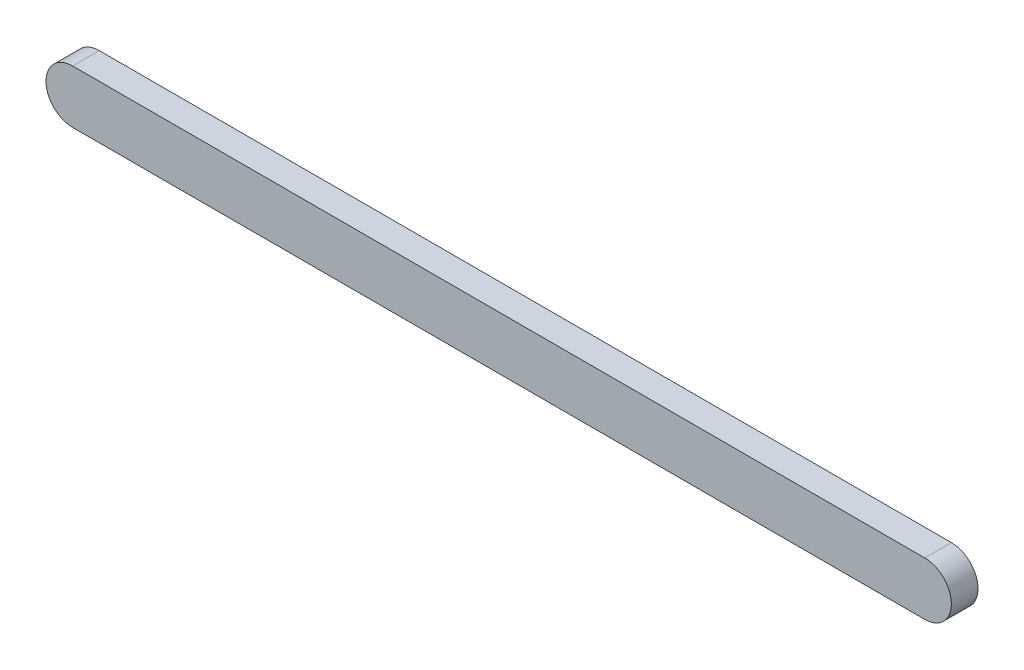
ISO-10303-21;
HEADER;
FILE_DESCRIPTION(('STEP AP214'),'2;1');
FILE_NAME('part.step','',(''),(''),'','','');
FILE_SCHEMA(('AUTOMOTIVE_DESIGN { 1 0 10303 214 1 1 1 1 }'));
ENDSEC;
DATA;
#1=APPLICATION_CONTEXT('core data for automotive mechanical design processes');
#2=APPLICATION_PROTOCOL_DEFINITION('international standard','automotive_design',2000,#1);
#3=PRODUCT_CONTEXT('',#1,'mechanical');
#4=PRODUCT('Part','Part','',(#3));
#5=PRODUCT_RELATED_PRODUCT_CATEGORY('part','',(#4));
#6=PRODUCT_DEFINITION_FORMATION('','',#4);
#7=PRODUCT_DEFINITION_CONTEXT('part definition',#1,'design');
#8=PRODUCT_DEFINITION('design','',#6,#7);
#9=PRODUCT_DEFINITION_SHAPE('','',#8);
#10=(LENGTH_UNIT() NAMED_UNIT(*) SI_UNIT(.MILLI.,.METRE.));
#11=(NAMED_UNIT(*) PLANE_ANGLE_UNIT() SI_UNIT($,.RADIAN.));
#12=(NAMED_UNIT(*) SI_UNIT($,.STERADIAN.) SOLID_ANGLE_UNIT());
#13=UNCERTAINTY_MEASURE_WITH_UNIT(LENGTH_MEASURE(1.E-05),#10,'distance_accuracy_value','');
#14=(GEOMETRIC_REPRESENTATION_CONTEXT(3) GLOBAL_UNCERTAINTY_ASSIGNED_CONTEXT((#13)) GLOBAL_UNIT_ASSIGNED_CONTEXT((#10,
#11,#12)) REPRESENTATION_CONTEXT('',''));
#15=CARTESIAN_POINT('',(0.,0.,0.));
#16=DIRECTION('',(0.,0.,1.));
#17=DIRECTION('',(1.,0.,0.));
#18=AXIS2_PLACEMENT_3D('',#15,#16,#17);
#19=CARTESIAN_POINT('',(0.,0.,2.5));
#20=DIRECTION('',(0.,0.,-1.));
#21=DIRECTION('',(-1.,0.,0.));
#22=AXIS2_PLACEMENT_3D('',#19,#20,#21);
#23=CYLINDRICAL_SURFACE('',#22,2.5);
#24=CARTESIAN_POINT('',(0.,0.,0.));
#25=DIRECTION('',(0.,0.,1.));
#26=DIRECTION('',(1.,0.,0.));
#27=AXIS2_PLACEMENT_3D('',#24,#25,#26);
#28=CIRCLE('',#27,2.5);
#29=CARTESIAN_POINT('',(0.,2.5,0.));
#30=VERTEX_POINT('',#29);
#31=CARTESIAN_POINT('',(0.,-2.5,0.));
#32=VERTEX_POINT('',#31);
#33=EDGE_CURVE('E95',#30,#32,#28,.T.);
#34=ORIENTED_EDGE('',*,*,#33,.T.);
#35=DIRECTION('',(0.,0.,-1.));
#36=VECTOR('',#35,1.);
#37=CARTESIAN_POINT('',(0.,-2.5,2.5));
#38=LINE('',#37,#36);
#39=CARTESIAN_POINT('',(0.,-2.5,2.5));
#40=VERTEX_POINT('',#39);
#41=EDGE_CURVE('E11',#40,#32,#38,.T.);
#42=ORIENTED_EDGE('',*,*,#41,.F.);
#43=CARTESIAN_POINT('',(0.,0.,2.5));
#44=DIRECTION('',(0.,0.,1.));
#45=DIRECTION('',(1.,0.,0.));
#46=AXIS2_PLACEMENT_3D('',#43,#44,#45);
#47=CIRCLE('',#46,2.5);
#48=CARTESIAN_POINT('',(0.,2.5,2.5));
#49=VERTEX_POINT('',#48);
#50=EDGE_CURVE('E83',#49,#40,#47,.T.);
#51=ORIENTED_EDGE('',*,*,#50,.F.);
#52=DIRECTION('',(0.,0.,-1.));
#53=VECTOR('',#52,1.);
#54=CARTESIAN_POINT('',(0.,2.5,2.5));
#55=LINE('',#54,#53);
#56=EDGE_CURVE('E91',#49,#30,#55,.T.);
#57=ORIENTED_EDGE('',*,*,#56,.T.);
#58=EDGE_LOOP('',(#34,#42,#51,#57));
#59=FACE_BOUND('',#58,.T.);
#60=ADVANCED_FACE('F32',(#59),#23,.T.);
#61=CARTESIAN_POINT('',(0.,-2.5,2.5));
#62=DIRECTION('',(0.,1.,0.));
#63=DIRECTION('',(0.,0.,1.));
#64=AXIS2_PLACEMENT_3D('',#61,#62,#63);
#65=PLANE('',#64);
#66=DIRECTION('',(1.,0.,0.));
#67=VECTOR('',#66,1.);
#68=CARTESIAN_POINT('',(0.,-2.5,0.));
#69=LINE('',#68,#67);
#70=CARTESIAN_POINT('',(80.,-2.5,0.));
#71=VERTEX_POINT('',#70);
#72=EDGE_CURVE('E87',#32,#71,#69,.T.);
#73=ORIENTED_EDGE('',*,*,#72,.T.);
#74=DIRECTION('',(0.,0.,-1.));
#75=VECTOR('',#74,1.);
#76=CARTESIAN_POINT('',(80.,-2.5,2.5));
#77=LINE('',#76,#75);
#78=CARTESIAN_POINT('',(80.,-2.5,2.5));
#79=VERTEX_POINT('',#78);
#80=EDGE_CURVE('E40',#79,#71,#77,.T.);
#81=ORIENTED_EDGE('',*,*,#80,.F.);
#82=DIRECTION('',(1.,0.,0.));
#83=VECTOR('',#82,1.);
#84=CARTESIAN_POINT('',(0.,-2.5,2.5));
#85=LINE('',#84,#83);
#86=EDGE_CURVE('E78',#40,#79,#85,.T.);
#87=ORIENTED_EDGE('',*,*,#86,.F.);
#88=ORIENTED_EDGE('',*,*,#41,.T.);
#89=EDGE_LOOP('',(#73,#81,#87,#88));
#90=FACE_BOUND('',#89,.T.);
#91=ADVANCED_FACE('F86',(#90),#65,.F.);
#92=CARTESIAN_POINT('',(80.,0.,2.5));
#93=DIRECTION('',(0.,0.,-1.));
#94=DIRECTION('',(-1.,0.,0.));
#95=AXIS2_PLACEMENT_3D('',#92,#93,#94);
#96=CYLINDRICAL_SURFACE('',#95,2.5);
#97=CARTESIAN_POINT('',(80.,0.,0.));
#98=DIRECTION('',(0.,0.,1.));
#99=DIRECTION('',(1.,0.,0.));
#100=AXIS2_PLACEMENT_3D('',#97,#98,#99);
#101=CIRCLE('',#100,2.5);
#102=CARTESIAN_POINT('',(80.,2.5,0.));
#103=VERTEX_POINT('',#102);
#104=EDGE_CURVE('E65',#71,#103,#101,.T.);
#105=ORIENTED_EDGE('',*,*,#104,.T.);
#106=DIRECTION('',(0.,0.,-1.));
#107=VECTOR('',#106,1.);
#108=CARTESIAN_POINT('',(80.,2.5,2.5));
#109=LINE('',#108,#107);
#110=CARTESIAN_POINT('',(80.,2.5,2.5));
#111=VERTEX_POINT('',#110);
#112=EDGE_CURVE('E88',#111,#103,#109,.T.);
#113=ORIENTED_EDGE('',*,*,#112,.F.);
#114=CARTESIAN_POINT('',(80.,0.,2.5));
#115=DIRECTION('',(0.,0.,1.));
#116=DIRECTION('',(1.,0.,0.));
#117=AXIS2_PLACEMENT_3D('',#114,#115,#116);
#118=CIRCLE('',#117,2.5);
#119=EDGE_CURVE('E81',#79,#111,#118,.T.);
#120=ORIENTED_EDGE('',*,*,#119,.F.);
#121=ORIENTED_EDGE('',*,*,#80,.T.);
#122=EDGE_LOOP('',(#105,#113,#120,#121));
#123=FACE_BOUND('',#122,.T.);
#124=ADVANCED_FACE('F89',(#123),#96,.T.);
#125=CARTESIAN_POINT('',(0.,2.5,2.5));
#126=DIRECTION('',(0.,-1.,0.));
#127=DIRECTION('',(0.,0.,-1.));
#128=AXIS2_PLACEMENT_3D('',#125,#126,#127);
#129=PLANE('',#128);
#130=DIRECTION('',(-1.,0.,0.));
#131=VECTOR('',#130,1.);
#132=CARTESIAN_POINT('',(0.,2.5,0.));
#133=LINE('',#132,#131);
#134=EDGE_CURVE('E71',#103,#30,#133,.T.);
#135=ORIENTED_EDGE('',*,*,#134,.T.);
#136=ORIENTED_EDGE('',*,*,#56,.F.);
#137=DIRECTION('',(-1.,0.,0.));
#138=VECTOR('',#137,1.);
#139=CARTESIAN_POINT('',(0.,2.5,2.5));
#140=LINE('',#139,#138);
#141=EDGE_CURVE('E48',#111,#49,#140,.T.);
#142=ORIENTED_EDGE('',*,*,#141,.F.);
#143=ORIENTED_EDGE('',*,*,#112,.T.);
#144=EDGE_LOOP('',(#135,#136,#142,#143));
#145=FACE_BOUND('',#144,.T.);
#146=ADVANCED_FACE('F102',(#145),#129,.F.);
#147=CARTESIAN_POINT('',(0.,0.,2.5));
#148=DIRECTION('',(0.,0.,1.));
#149=DIRECTION('',(1.,0.,0.));
#150=AXIS2_PLACEMENT_3D('',#147,#148,#149);
#151=PLANE('',#150);
#152=ORIENTED_EDGE('',*,*,#50,.T.);
#153=ORIENTED_EDGE('',*,*,#86,.T.);
#154=ORIENTED_EDGE('',*,*,#119,.T.);
#155=ORIENTED_EDGE('',*,*,#141,.T.);
#156=EDGE_LOOP('',(#152,#153,#154,#155));
#157=FACE_BOUND('',#156,.T.);
#158=ADVANCED_FACE('F79',(#157),#151,.T.);
#159=CARTESIAN_POINT('',(0.,0.,0.));
#160=DIRECTION('',(0.,0.,1.));
#161=DIRECTION('',(1.,0.,0.));
#162=AXIS2_PLACEMENT_3D('',#159,#160,#161);
#163=PLANE('',#162);
#164=ORIENTED_EDGE('',*,*,#33,.F.);
#165=ORIENTED_EDGE('',*,*,#134,.F.);
#166=ORIENTED_EDGE('',*,*,#104,.F.);
#167=ORIENTED_EDGE('',*,*,#72,.F.);
#168=EDGE_LOOP('',(#164,#165,#166,#167));
#169=FACE_BOUND('',#168,.T.);
#170=ADVANCED_FACE('F105',(#169),#163,.F.);
#171=CLOSED_SHELL('',(#60,#91,#124,#146,#158,#170));
#172=MANIFOLD_SOLID_BREP('B2',#171);
#173=ADVANCED_BREP_SHAPE_REPRESENTATION('',(#18,#172),#14);
#174=SHAPE_DEFINITION_REPRESENTATION(#9,#173);
ENDSEC;
END-ISO-10303-21;
